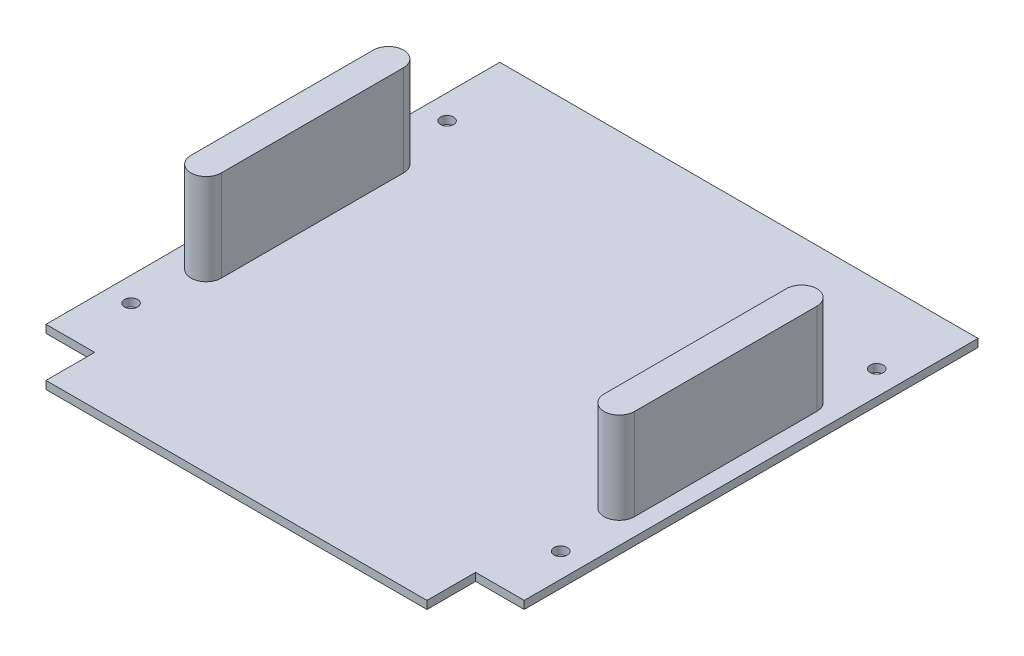
ISO-10303-21;
HEADER;
FILE_DESCRIPTION(('STEP AP214'),'2;1');
FILE_NAME('part.step','',(''),(''),'','','');
FILE_SCHEMA(('AUTOMOTIVE_DESIGN { 1 0 10303 214 1 1 1 1 }'));
ENDSEC;
DATA;
#1=APPLICATION_CONTEXT('core data for automotive mechanical design processes');
#2=APPLICATION_PROTOCOL_DEFINITION('international standard','automotive_design',2000,#1);
#3=PRODUCT_CONTEXT('',#1,'mechanical');
#4=PRODUCT('Part','Part','',(#3));
#5=PRODUCT_RELATED_PRODUCT_CATEGORY('part','',(#4));
#6=PRODUCT_DEFINITION_FORMATION('','',#4);
#7=PRODUCT_DEFINITION_CONTEXT('part definition',#1,'design');
#8=PRODUCT_DEFINITION('design','',#6,#7);
#9=PRODUCT_DEFINITION_SHAPE('','',#8);
#10=(LENGTH_UNIT() NAMED_UNIT(*) SI_UNIT(.MILLI.,.METRE.));
#11=(NAMED_UNIT(*) PLANE_ANGLE_UNIT() SI_UNIT($,.RADIAN.));
#12=(NAMED_UNIT(*) SI_UNIT($,.STERADIAN.) SOLID_ANGLE_UNIT());
#13=UNCERTAINTY_MEASURE_WITH_UNIT(LENGTH_MEASURE(1.E-05),#10,'distance_accuracy_value','');
#14=(GEOMETRIC_REPRESENTATION_CONTEXT(3) GLOBAL_UNCERTAINTY_ASSIGNED_CONTEXT((#13)) GLOBAL_UNIT_ASSIGNED_CONTEXT((#10,
#11,#12)) REPRESENTATION_CONTEXT('',''));
#15=CARTESIAN_POINT('',(0.,0.,0.));
#16=DIRECTION('',(0.,0.,1.));
#17=DIRECTION('',(1.,0.,0.));
#18=AXIS2_PLACEMENT_3D('',#15,#16,#17);
#19=CARTESIAN_POINT('',(0.,3.302,0.));
#20=DIRECTION('',(0.,1.,0.));
#21=DIRECTION('',(0.,0.,1.));
#22=AXIS2_PLACEMENT_3D('',#19,#20,#21);
#23=PLANE('',#22);
#24=CARTESIAN_POINT('',(-89.789,3.302,55.88));
#25=DIRECTION('',(0.,1.,0.));
#26=DIRECTION('',(0.,0.,1.));
#27=AXIS2_PLACEMENT_3D('',#24,#25,#26);
#28=CIRCLE('',#27,2.74999999999997);
#29=CARTESIAN_POINT('',(-89.789,3.302,58.63));
#30=VERTEX_POINT('',#29);
#31=EDGE_CURVE('E193',#30,#30,#28,.T.);
#32=ORIENTED_EDGE('',*,*,#31,.F.);
#33=EDGE_LOOP('',(#32));
#34=FACE_BOUND('',#33,.T.);
#35=CARTESIAN_POINT('',(-89.789,3.302,-76.2));
#36=DIRECTION('',(0.,1.,0.));
#37=DIRECTION('',(0.,0.,1.));
#38=AXIS2_PLACEMENT_3D('',#35,#36,#37);
#39=CIRCLE('',#38,2.74999999999997);
#40=CARTESIAN_POINT('',(-89.789,3.302,-73.4500000000001));
#41=VERTEX_POINT('',#40);
#42=EDGE_CURVE('E201',#41,#41,#39,.T.);
#43=ORIENTED_EDGE('',*,*,#42,.F.);
#44=EDGE_LOOP('',(#43));
#45=FACE_BOUND('',#44,.T.);
#46=CARTESIAN_POINT('',(89.789,3.302,55.88));
#47=DIRECTION('',(0.,1.,0.));
#48=DIRECTION('',(0.,0.,1.));
#49=AXIS2_PLACEMENT_3D('',#46,#47,#48);
#50=CIRCLE('',#49,2.74999999999997);
#51=CARTESIAN_POINT('',(89.789,3.302,58.63));
#52=VERTEX_POINT('',#51);
#53=EDGE_CURVE('E209',#52,#52,#50,.T.);
#54=ORIENTED_EDGE('',*,*,#53,.F.);
#55=EDGE_LOOP('',(#54));
#56=FACE_BOUND('',#55,.T.);
#57=CARTESIAN_POINT('',(89.789,3.302,-76.2));
#58=DIRECTION('',(0.,1.,0.));
#59=DIRECTION('',(0.,0.,1.));
#60=AXIS2_PLACEMENT_3D('',#57,#58,#59);
#61=CIRCLE('',#60,2.74999999999997);
#62=CARTESIAN_POINT('',(89.789,3.302,-73.4500000000001));
#63=VERTEX_POINT('',#62);
#64=EDGE_CURVE('E217',#63,#63,#61,.T.);
#65=ORIENTED_EDGE('',*,*,#64,.F.);
#66=EDGE_LOOP('',(#65));
#67=FACE_BOUND('',#66,.T.);
#68=DIRECTION('',(0.,0.,1.));
#69=VECTOR('',#68,1.);
#70=CARTESIAN_POINT('',(79.629,3.302,0.));
#71=LINE('',#70,#69);
#72=CARTESIAN_POINT('',(79.629,3.302,81.28));
#73=VERTEX_POINT('',#72);
#74=CARTESIAN_POINT('',(79.629,3.302,101.6));
#75=VERTEX_POINT('',#74);
#76=EDGE_CURVE('E304',#73,#75,#71,.T.);
#77=ORIENTED_EDGE('',*,*,#76,.F.);
#78=DIRECTION('',(-1.,0.,0.));
#79=VECTOR('',#78,1.);
#80=CARTESIAN_POINT('',(0.,3.302,81.28));
#81=LINE('',#80,#79);
#82=CARTESIAN_POINT('',(99.949,3.302,81.28));
#83=VERTEX_POINT('',#82);
#84=EDGE_CURVE('E308',#83,#73,#81,.T.);
#85=ORIENTED_EDGE('',*,*,#84,.F.);
#86=DIRECTION('',(0.,0.,1.));
#87=VECTOR('',#86,1.);
#88=CARTESIAN_POINT('',(99.949,3.302,0.));
#89=LINE('',#88,#87);
#90=CARTESIAN_POINT('',(99.949,3.302,-108.4));
#91=VERTEX_POINT('',#90);
#92=EDGE_CURVE('E313',#91,#83,#89,.T.);
#93=ORIENTED_EDGE('',*,*,#92,.F.);
#94=DIRECTION('',(1.,0.,0.));
#95=VECTOR('',#94,1.);
#96=CARTESIAN_POINT('',(99.949,3.302,-108.4));
#97=LINE('',#96,#95);
#98=CARTESIAN_POINT('',(-99.949,3.302,-108.4));
#99=VERTEX_POINT('',#98);
#100=EDGE_CURVE('E185',#99,#91,#97,.T.);
#101=ORIENTED_EDGE('',*,*,#100,.F.);
#102=DIRECTION('',(0.,0.,1.));
#103=VECTOR('',#102,1.);
#104=CARTESIAN_POINT('',(-99.949,3.302,0.));
#105=LINE('',#104,#103);
#106=CARTESIAN_POINT('',(-99.949,3.302,81.28));
#107=VERTEX_POINT('',#106);
#108=EDGE_CURVE('E316',#99,#107,#105,.T.);
#109=ORIENTED_EDGE('',*,*,#108,.T.);
#110=DIRECTION('',(1.,0.,0.));
#111=VECTOR('',#110,1.);
#112=CARTESIAN_POINT('',(0.,3.302,81.28));
#113=LINE('',#112,#111);
#114=CARTESIAN_POINT('',(-79.629,3.302,81.28));
#115=VERTEX_POINT('',#114);
#116=EDGE_CURVE('E319',#107,#115,#113,.T.);
#117=ORIENTED_EDGE('',*,*,#116,.T.);
#118=DIRECTION('',(0.,0.,1.));
#119=VECTOR('',#118,1.);
#120=CARTESIAN_POINT('',(-79.629,3.302,0.));
#121=LINE('',#120,#119);
#122=CARTESIAN_POINT('',(-79.629,3.302,101.6));
#123=VERTEX_POINT('',#122);
#124=EDGE_CURVE('E322',#115,#123,#121,.T.);
#125=ORIENTED_EDGE('',*,*,#124,.T.);
#126=DIRECTION('',(-1.,0.,0.));
#127=VECTOR('',#126,1.);
#128=CARTESIAN_POINT('',(0.,3.302,101.6));
#129=LINE('',#128,#127);
#130=EDGE_CURVE('E325',#75,#123,#129,.T.);
#131=ORIENTED_EDGE('',*,*,#130,.F.);
#132=EDGE_LOOP('',(#77,#85,#93,#101,#109,#117,#125,#131));
#133=FACE_BOUND('',#132,.T.);
#134=DIRECTION('',(0.,0.,1.));
#135=VECTOR('',#134,1.);
#136=CARTESIAN_POINT('',(80.01,3.302,-48.26));
#137=LINE('',#136,#135);
#138=CARTESIAN_POINT('',(80.01,3.302,-48.26));
#139=VERTEX_POINT('',#138);
#140=CARTESIAN_POINT('',(80.01,3.302,27.94));
#141=VERTEX_POINT('',#140);
#142=EDGE_CURVE('E283',#139,#141,#137,.T.);
#143=ORIENTED_EDGE('',*,*,#142,.F.);
#144=CARTESIAN_POINT('',(86.36,3.302,-48.26));
#145=DIRECTION('',(0.,1.,0.));
#146=DIRECTION('',(0.,0.,1.));
#147=AXIS2_PLACEMENT_3D('',#144,#145,#146);
#148=CIRCLE('',#147,6.35);
#149=CARTESIAN_POINT('',(92.71,3.302,-48.26));
#150=VERTEX_POINT('',#149);
#151=EDGE_CURVE('E264',#150,#139,#148,.T.);
#152=ORIENTED_EDGE('',*,*,#151,.F.);
#153=DIRECTION('',(0.,0.,-1.));
#154=VECTOR('',#153,1.);
#155=CARTESIAN_POINT('',(92.71,3.302,-48.26));
#156=LINE('',#155,#154);
#157=CARTESIAN_POINT('',(92.71,3.302,27.94));
#158=VERTEX_POINT('',#157);
#159=EDGE_CURVE('E270',#158,#150,#156,.T.);
#160=ORIENTED_EDGE('',*,*,#159,.F.);
#161=CARTESIAN_POINT('',(86.36,3.302,27.94));
#162=DIRECTION('',(0.,1.,0.));
#163=DIRECTION('',(0.,0.,1.));
#164=AXIS2_PLACEMENT_3D('',#161,#162,#163);
#165=CIRCLE('',#164,6.35);
#166=EDGE_CURVE('E286',#141,#158,#165,.T.);
#167=ORIENTED_EDGE('',*,*,#166,.F.);
#168=EDGE_LOOP('',(#143,#152,#160,#167));
#169=FACE_BOUND('',#168,.T.);
#170=DIRECTION('',(0.,0.,1.));
#171=VECTOR('',#170,1.);
#172=CARTESIAN_POINT('',(-92.71,3.302,-48.26));
#173=LINE('',#172,#171);
#174=CARTESIAN_POINT('',(-92.71,3.302,-48.26));
#175=VERTEX_POINT('',#174);
#176=CARTESIAN_POINT('',(-92.71,3.302,27.94));
#177=VERTEX_POINT('',#176);
#178=EDGE_CURVE('E244',#175,#177,#173,.T.);
#179=ORIENTED_EDGE('',*,*,#178,.F.);
#180=CARTESIAN_POINT('',(-86.36,3.302,-48.26));
#181=DIRECTION('',(0.,1.,0.));
#182=DIRECTION('',(0.,0.,1.));
#183=AXIS2_PLACEMENT_3D('',#180,#181,#182);
#184=CIRCLE('',#183,6.35);
#185=CARTESIAN_POINT('',(-80.01,3.302,-48.26));
#186=VERTEX_POINT('',#185);
#187=EDGE_CURVE('E225',#186,#175,#184,.T.);
#188=ORIENTED_EDGE('',*,*,#187,.F.);
#189=DIRECTION('',(0.,0.,-1.));
#190=VECTOR('',#189,1.);
#191=CARTESIAN_POINT('',(-80.01,3.302,-48.26));
#192=LINE('',#191,#190);
#193=CARTESIAN_POINT('',(-80.01,3.302,27.94));
#194=VERTEX_POINT('',#193);
#195=EDGE_CURVE('E231',#194,#186,#192,.T.);
#196=ORIENTED_EDGE('',*,*,#195,.F.);
#197=CARTESIAN_POINT('',(-86.36,3.302,27.94));
#198=DIRECTION('',(0.,1.,0.));
#199=DIRECTION('',(0.,0.,1.));
#200=AXIS2_PLACEMENT_3D('',#197,#198,#199);
#201=CIRCLE('',#200,6.35);
#202=EDGE_CURVE('E247',#177,#194,#201,.T.);
#203=ORIENTED_EDGE('',*,*,#202,.F.);
#204=EDGE_LOOP('',(#179,#188,#196,#203));
#205=FACE_BOUND('',#204,.T.);
#206=ADVANCED_FACE('F43',(#34,#45,#56,#67,#133,#169,#205),#23,.T.);
#207=CARTESIAN_POINT('',(79.629,3.302,0.));
#208=DIRECTION('',(1.,0.,0.));
#209=DIRECTION('',(0.,0.,-1.));
#210=AXIS2_PLACEMENT_3D('',#207,#208,#209);
#211=PLANE('',#210);
#212=DIRECTION('',(0.,0.,1.));
#213=VECTOR('',#212,1.);
#214=CARTESIAN_POINT('',(79.629,0.,0.));
#215=LINE('',#214,#213);
#216=CARTESIAN_POINT('',(79.629,0.,81.28));
#217=VERTEX_POINT('',#216);
#218=CARTESIAN_POINT('',(79.629,0.,101.6));
#219=VERTEX_POINT('',#218);
#220=EDGE_CURVE('E303',#217,#219,#215,.T.);
#221=ORIENTED_EDGE('',*,*,#220,.F.);
#222=DIRECTION('',(0.,-1.,0.));
#223=VECTOR('',#222,1.);
#224=CARTESIAN_POINT('',(79.629,3.302,81.28));
#225=LINE('',#224,#223);
#226=EDGE_CURVE('E11',#73,#217,#225,.T.);
#227=ORIENTED_EDGE('',*,*,#226,.F.);
#228=ORIENTED_EDGE('',*,*,#76,.T.);
#229=DIRECTION('',(0.,-1.,0.));
#230=VECTOR('',#229,1.);
#231=CARTESIAN_POINT('',(79.629,3.302,101.6));
#232=LINE('',#231,#230);
#233=EDGE_CURVE('E329',#75,#219,#232,.T.);
#234=ORIENTED_EDGE('',*,*,#233,.T.);
#235=EDGE_LOOP('',(#221,#227,#228,#234));
#236=FACE_BOUND('',#235,.T.);
#237=ADVANCED_FACE('F45',(#236),#211,.T.);
#238=CARTESIAN_POINT('',(0.,3.302,81.28));
#239=DIRECTION('',(0.,0.,1.));
#240=DIRECTION('',(1.,0.,0.));
#241=AXIS2_PLACEMENT_3D('',#238,#239,#240);
#242=PLANE('',#241);
#243=DIRECTION('',(-1.,0.,0.));
#244=VECTOR('',#243,1.);
#245=CARTESIAN_POINT('',(0.,0.,81.28));
#246=LINE('',#245,#244);
#247=CARTESIAN_POINT('',(99.949,0.,81.28));
#248=VERTEX_POINT('',#247);
#249=EDGE_CURVE('E169',#248,#217,#246,.T.);
#250=ORIENTED_EDGE('',*,*,#249,.F.);
#251=DIRECTION('',(0.,-1.,0.));
#252=VECTOR('',#251,1.);
#253=CARTESIAN_POINT('',(99.949,3.302,81.28));
#254=LINE('',#253,#252);
#255=EDGE_CURVE('E52',#83,#248,#254,.T.);
#256=ORIENTED_EDGE('',*,*,#255,.F.);
#257=ORIENTED_EDGE('',*,*,#84,.T.);
#258=ORIENTED_EDGE('',*,*,#226,.T.);
#259=EDGE_LOOP('',(#250,#256,#257,#258));
#260=FACE_BOUND('',#259,.T.);
#261=ADVANCED_FACE('F384',(#260),#242,.T.);
#262=CARTESIAN_POINT('',(99.949,3.302,0.));
#263=DIRECTION('',(1.,0.,0.));
#264=DIRECTION('',(0.,0.,-1.));
#265=AXIS2_PLACEMENT_3D('',#262,#263,#264);
#266=PLANE('',#265);
#267=DIRECTION('',(0.,0.,1.));
#268=VECTOR('',#267,1.);
#269=CARTESIAN_POINT('',(99.949,0.,0.));
#270=LINE('',#269,#268);
#271=CARTESIAN_POINT('',(99.949,0.,-108.4));
#272=VERTEX_POINT('',#271);
#273=EDGE_CURVE('E158',#272,#248,#270,.T.);
#274=ORIENTED_EDGE('',*,*,#273,.F.);
#275=DIRECTION('',(0.,-1.,0.));
#276=VECTOR('',#275,1.);
#277=CARTESIAN_POINT('',(99.949,3.302,-108.4));
#278=LINE('',#277,#276);
#279=EDGE_CURVE('E163',#91,#272,#278,.T.);
#280=ORIENTED_EDGE('',*,*,#279,.F.);
#281=ORIENTED_EDGE('',*,*,#92,.T.);
#282=ORIENTED_EDGE('',*,*,#255,.T.);
#283=EDGE_LOOP('',(#274,#280,#281,#282));
#284=FACE_BOUND('',#283,.T.);
#285=ADVANCED_FACE('F160',(#284),#266,.T.);
#286=CARTESIAN_POINT('',(-99.949,3.302,0.));
#287=DIRECTION('',(1.,0.,0.));
#288=DIRECTION('',(0.,0.,-1.));
#289=AXIS2_PLACEMENT_3D('',#286,#287,#288);
#290=PLANE('',#289);
#291=DIRECTION('',(0.,0.,1.));
#292=VECTOR('',#291,1.);
#293=CARTESIAN_POINT('',(-99.949,0.,0.));
#294=LINE('',#293,#292);
#295=CARTESIAN_POINT('',(-99.949,0.,-108.4));
#296=VERTEX_POINT('',#295);
#297=CARTESIAN_POINT('',(-99.949,0.,81.28));
#298=VERTEX_POINT('',#297);
#299=EDGE_CURVE('E168',#296,#298,#294,.T.);
#300=ORIENTED_EDGE('',*,*,#299,.T.);
#301=DIRECTION('',(0.,-1.,0.));
#302=VECTOR('',#301,1.);
#303=CARTESIAN_POINT('',(-99.949,3.302,81.28));
#304=LINE('',#303,#302);
#305=EDGE_CURVE('E355',#107,#298,#304,.T.);
#306=ORIENTED_EDGE('',*,*,#305,.F.);
#307=ORIENTED_EDGE('',*,*,#108,.F.);
#308=DIRECTION('',(0.,1.,0.));
#309=VECTOR('',#308,1.);
#310=CARTESIAN_POINT('',(-99.949,3.302,-108.4));
#311=LINE('',#310,#309);
#312=EDGE_CURVE('E180',#296,#99,#311,.T.);
#313=ORIENTED_EDGE('',*,*,#312,.F.);
#314=EDGE_LOOP('',(#300,#306,#307,#313));
#315=FACE_BOUND('',#314,.T.);
#316=ADVANCED_FACE('F375',(#315),#290,.F.);
#317=CARTESIAN_POINT('',(0.,3.302,81.28));
#318=DIRECTION('',(0.,0.,-1.));
#319=DIRECTION('',(-1.,0.,0.));
#320=AXIS2_PLACEMENT_3D('',#317,#318,#319);
#321=PLANE('',#320);
#322=DIRECTION('',(1.,0.,0.));
#323=VECTOR('',#322,1.);
#324=CARTESIAN_POINT('',(0.,0.,81.28));
#325=LINE('',#324,#323);
#326=CARTESIAN_POINT('',(-79.629,0.,81.28));
#327=VERTEX_POINT('',#326);
#328=EDGE_CURVE('E336',#298,#327,#325,.T.);
#329=ORIENTED_EDGE('',*,*,#328,.T.);
#330=DIRECTION('',(0.,-1.,0.));
#331=VECTOR('',#330,1.);
#332=CARTESIAN_POINT('',(-79.629,3.302,81.28));
#333=LINE('',#332,#331);
#334=EDGE_CURVE('E351',#115,#327,#333,.T.);
#335=ORIENTED_EDGE('',*,*,#334,.F.);
#336=ORIENTED_EDGE('',*,*,#116,.F.);
#337=ORIENTED_EDGE('',*,*,#305,.T.);
#338=EDGE_LOOP('',(#329,#335,#336,#337));
#339=FACE_BOUND('',#338,.T.);
#340=ADVANCED_FACE('F362',(#339),#321,.F.);
#341=CARTESIAN_POINT('',(-79.629,3.302,0.));
#342=DIRECTION('',(1.,0.,0.));
#343=DIRECTION('',(0.,0.,-1.));
#344=AXIS2_PLACEMENT_3D('',#341,#342,#343);
#345=PLANE('',#344);
#346=DIRECTION('',(0.,0.,1.));
#347=VECTOR('',#346,1.);
#348=CARTESIAN_POINT('',(-79.629,0.,0.));
#349=LINE('',#348,#347);
#350=CARTESIAN_POINT('',(-79.629,0.,101.6));
#351=VERTEX_POINT('',#350);
#352=EDGE_CURVE('E339',#327,#351,#349,.T.);
#353=ORIENTED_EDGE('',*,*,#352,.T.);
#354=DIRECTION('',(0.,-1.,0.));
#355=VECTOR('',#354,1.);
#356=CARTESIAN_POINT('',(-79.629,3.302,101.6));
#357=LINE('',#356,#355);
#358=EDGE_CURVE('E348',#123,#351,#357,.T.);
#359=ORIENTED_EDGE('',*,*,#358,.F.);
#360=ORIENTED_EDGE('',*,*,#124,.F.);
#361=ORIENTED_EDGE('',*,*,#334,.T.);
#362=EDGE_LOOP('',(#353,#359,#360,#361));
#363=FACE_BOUND('',#362,.T.);
#364=ADVANCED_FACE('F369',(#363),#345,.F.);
#365=CARTESIAN_POINT('',(0.,3.302,101.6));
#366=DIRECTION('',(0.,0.,1.));
#367=DIRECTION('',(1.,0.,0.));
#368=AXIS2_PLACEMENT_3D('',#365,#366,#367);
#369=PLANE('',#368);
#370=DIRECTION('',(-1.,0.,0.));
#371=VECTOR('',#370,1.);
#372=CARTESIAN_POINT('',(0.,0.,101.6));
#373=LINE('',#372,#371);
#374=EDGE_CURVE('E309',#219,#351,#373,.T.);
#375=ORIENTED_EDGE('',*,*,#374,.F.);
#376=ORIENTED_EDGE('',*,*,#233,.F.);
#377=ORIENTED_EDGE('',*,*,#130,.T.);
#378=ORIENTED_EDGE('',*,*,#358,.T.);
#379=EDGE_LOOP('',(#375,#376,#377,#378));
#380=FACE_BOUND('',#379,.T.);
#381=ADVANCED_FACE('F401',(#380),#369,.T.);
#382=CARTESIAN_POINT('',(0.,0.,0.));
#383=DIRECTION('',(0.,1.,0.));
#384=DIRECTION('',(0.,0.,1.));
#385=AXIS2_PLACEMENT_3D('',#382,#383,#384);
#386=PLANE('',#385);
#387=CARTESIAN_POINT('',(-89.789,0.,55.88));
#388=DIRECTION('',(0.,1.,0.));
#389=DIRECTION('',(0.,0.,1.));
#390=AXIS2_PLACEMENT_3D('',#387,#388,#389);
#391=CIRCLE('',#390,2.74999999999997);
#392=CARTESIAN_POINT('',(-89.789,0.,58.63));
#393=VERTEX_POINT('',#392);
#394=EDGE_CURVE('E197',#393,#393,#391,.T.);
#395=ORIENTED_EDGE('',*,*,#394,.T.);
#396=EDGE_LOOP('',(#395));
#397=FACE_BOUND('',#396,.T.);
#398=CARTESIAN_POINT('',(-89.789,0.,-76.2));
#399=DIRECTION('',(0.,1.,0.));
#400=DIRECTION('',(0.,0.,1.));
#401=AXIS2_PLACEMENT_3D('',#398,#399,#400);
#402=CIRCLE('',#401,2.74999999999997);
#403=CARTESIAN_POINT('',(-89.789,0.,-73.4500000000001));
#404=VERTEX_POINT('',#403);
#405=EDGE_CURVE('E205',#404,#404,#402,.T.);
#406=ORIENTED_EDGE('',*,*,#405,.T.);
#407=EDGE_LOOP('',(#406));
#408=FACE_BOUND('',#407,.T.);
#409=CARTESIAN_POINT('',(89.789,0.,55.88));
#410=DIRECTION('',(0.,1.,0.));
#411=DIRECTION('',(0.,0.,1.));
#412=AXIS2_PLACEMENT_3D('',#409,#410,#411);
#413=CIRCLE('',#412,2.74999999999997);
#414=CARTESIAN_POINT('',(89.789,0.,58.63));
#415=VERTEX_POINT('',#414);
#416=EDGE_CURVE('E213',#415,#415,#413,.T.);
#417=ORIENTED_EDGE('',*,*,#416,.T.);
#418=EDGE_LOOP('',(#417));
#419=FACE_BOUND('',#418,.T.);
#420=CARTESIAN_POINT('',(89.789,0.,-76.2));
#421=DIRECTION('',(0.,1.,0.));
#422=DIRECTION('',(0.,0.,1.));
#423=AXIS2_PLACEMENT_3D('',#420,#421,#422);
#424=CIRCLE('',#423,2.74999999999997);
#425=CARTESIAN_POINT('',(89.789,0.,-73.4500000000001));
#426=VERTEX_POINT('',#425);
#427=EDGE_CURVE('E221',#426,#426,#424,.T.);
#428=ORIENTED_EDGE('',*,*,#427,.T.);
#429=EDGE_LOOP('',(#428));
#430=FACE_BOUND('',#429,.T.);
#431=ORIENTED_EDGE('',*,*,#220,.T.);
#432=ORIENTED_EDGE('',*,*,#374,.T.);
#433=ORIENTED_EDGE('',*,*,#352,.F.);
#434=ORIENTED_EDGE('',*,*,#328,.F.);
#435=ORIENTED_EDGE('',*,*,#299,.F.);
#436=DIRECTION('',(-1.,0.,0.));
#437=VECTOR('',#436,1.);
#438=CARTESIAN_POINT('',(99.949,0.,-108.4));
#439=LINE('',#438,#437);
#440=EDGE_CURVE('E172',#272,#296,#439,.T.);
#441=ORIENTED_EDGE('',*,*,#440,.F.);
#442=ORIENTED_EDGE('',*,*,#273,.T.);
#443=ORIENTED_EDGE('',*,*,#249,.T.);
#444=EDGE_LOOP('',(#431,#432,#433,#434,#435,#441,#442,#443));
#445=FACE_BOUND('',#444,.T.);
#446=ADVANCED_FACE('F174',(#397,#408,#419,#430,#445),#386,.F.);
#447=CARTESIAN_POINT('',(86.36,41.402,-48.26));
#448=DIRECTION('',(0.,-1.,0.));
#449=DIRECTION('',(0.,0.,-1.));
#450=AXIS2_PLACEMENT_3D('',#447,#448,#449);
#451=CYLINDRICAL_SURFACE('',#450,6.35);
#452=ORIENTED_EDGE('',*,*,#151,.T.);
#453=DIRECTION('',(0.,-1.,0.));
#454=VECTOR('',#453,1.);
#455=CARTESIAN_POINT('',(80.01,41.402,-48.26));
#456=LINE('',#455,#454);
#457=CARTESIAN_POINT('',(80.01,41.402,-48.26));
#458=VERTEX_POINT('',#457);
#459=EDGE_CURVE('E300',#458,#139,#456,.T.);
#460=ORIENTED_EDGE('',*,*,#459,.F.);
#461=CARTESIAN_POINT('',(86.36,41.402,-48.26));
#462=DIRECTION('',(0.,1.,0.));
#463=DIRECTION('',(0.,0.,1.));
#464=AXIS2_PLACEMENT_3D('',#461,#462,#463);
#465=CIRCLE('',#464,6.35);
#466=CARTESIAN_POINT('',(92.71,41.402,-48.26));
#467=VERTEX_POINT('',#466);
#468=EDGE_CURVE('E265',#467,#458,#465,.T.);
#469=ORIENTED_EDGE('',*,*,#468,.F.);
#470=DIRECTION('',(0.,-1.,0.));
#471=VECTOR('',#470,1.);
#472=CARTESIAN_POINT('',(92.71,41.402,-48.26));
#473=LINE('',#472,#471);
#474=EDGE_CURVE('E279',#467,#150,#473,.T.);
#475=ORIENTED_EDGE('',*,*,#474,.T.);
#476=EDGE_LOOP('',(#452,#460,#469,#475));
#477=FACE_BOUND('',#476,.T.);
#478=ADVANCED_FACE('F398',(#477),#451,.T.);
#479=CARTESIAN_POINT('',(80.01,41.402,-48.26));
#480=DIRECTION('',(1.,0.,0.));
#481=DIRECTION('',(0.,0.,-1.));
#482=AXIS2_PLACEMENT_3D('',#479,#480,#481);
#483=PLANE('',#482);
#484=ORIENTED_EDGE('',*,*,#142,.T.);
#485=DIRECTION('',(0.,-1.,0.));
#486=VECTOR('',#485,1.);
#487=CARTESIAN_POINT('',(80.01,41.402,27.94));
#488=LINE('',#487,#486);
#489=CARTESIAN_POINT('',(80.01,41.402,27.94));
#490=VERTEX_POINT('',#489);
#491=EDGE_CURVE('E296',#490,#141,#488,.T.);
#492=ORIENTED_EDGE('',*,*,#491,.F.);
#493=DIRECTION('',(0.,0.,1.));
#494=VECTOR('',#493,1.);
#495=CARTESIAN_POINT('',(80.01,41.402,-48.26));
#496=LINE('',#495,#494);
#497=EDGE_CURVE('E269',#458,#490,#496,.T.);
#498=ORIENTED_EDGE('',*,*,#497,.F.);
#499=ORIENTED_EDGE('',*,*,#459,.T.);
#500=EDGE_LOOP('',(#484,#492,#498,#499));
#501=FACE_BOUND('',#500,.T.);
#502=ADVANCED_FACE('F422',(#501),#483,.F.);
#503=CARTESIAN_POINT('',(86.36,41.402,27.94));
#504=DIRECTION('',(0.,-1.,0.));
#505=DIRECTION('',(0.,0.,-1.));
#506=AXIS2_PLACEMENT_3D('',#503,#504,#505);
#507=CYLINDRICAL_SURFACE('',#506,6.35);
#508=ORIENTED_EDGE('',*,*,#166,.T.);
#509=DIRECTION('',(0.,-1.,0.));
#510=VECTOR('',#509,1.);
#511=CARTESIAN_POINT('',(92.71,41.402,27.94));
#512=LINE('',#511,#510);
#513=CARTESIAN_POINT('',(92.71,41.402,27.94));
#514=VERTEX_POINT('',#513);
#515=EDGE_CURVE('E67',#514,#158,#512,.T.);
#516=ORIENTED_EDGE('',*,*,#515,.F.);
#517=CARTESIAN_POINT('',(86.36,41.402,27.94));
#518=DIRECTION('',(0.,1.,0.));
#519=DIRECTION('',(0.,0.,1.));
#520=AXIS2_PLACEMENT_3D('',#517,#518,#519);
#521=CIRCLE('',#520,6.35);
#522=EDGE_CURVE('E273',#490,#514,#521,.T.);
#523=ORIENTED_EDGE('',*,*,#522,.F.);
#524=ORIENTED_EDGE('',*,*,#491,.T.);
#525=EDGE_LOOP('',(#508,#516,#523,#524));
#526=FACE_BOUND('',#525,.T.);
#527=ADVANCED_FACE('F429',(#526),#507,.T.);
#528=CARTESIAN_POINT('',(92.71,41.402,-48.26));
#529=DIRECTION('',(-1.,0.,0.));
#530=DIRECTION('',(0.,0.,1.));
#531=AXIS2_PLACEMENT_3D('',#528,#529,#530);
#532=PLANE('',#531);
#533=ORIENTED_EDGE('',*,*,#159,.T.);
#534=ORIENTED_EDGE('',*,*,#474,.F.);
#535=DIRECTION('',(0.,0.,-1.));
#536=VECTOR('',#535,1.);
#537=CARTESIAN_POINT('',(92.71,41.402,-48.26));
#538=LINE('',#537,#536);
#539=EDGE_CURVE('E276',#514,#467,#538,.T.);
#540=ORIENTED_EDGE('',*,*,#539,.F.);
#541=ORIENTED_EDGE('',*,*,#515,.T.);
#542=EDGE_LOOP('',(#533,#534,#540,#541));
#543=FACE_BOUND('',#542,.T.);
#544=ADVANCED_FACE('F436',(#543),#532,.F.);
#545=CARTESIAN_POINT('',(86.36,41.402,-48.26));
#546=DIRECTION('',(0.,1.,0.));
#547=DIRECTION('',(0.,0.,1.));
#548=AXIS2_PLACEMENT_3D('',#545,#546,#547);
#549=PLANE('',#548);
#550=ORIENTED_EDGE('',*,*,#468,.T.);
#551=ORIENTED_EDGE('',*,*,#497,.T.);
#552=ORIENTED_EDGE('',*,*,#522,.T.);
#553=ORIENTED_EDGE('',*,*,#539,.T.);
#554=EDGE_LOOP('',(#550,#551,#552,#553));
#555=FACE_BOUND('',#554,.T.);
#556=ADVANCED_FACE('F444',(#555),#549,.T.);
#557=CARTESIAN_POINT('',(-86.36,41.402,-48.26));
#558=DIRECTION('',(0.,-1.,0.));
#559=DIRECTION('',(0.,0.,-1.));
#560=AXIS2_PLACEMENT_3D('',#557,#558,#559);
#561=CYLINDRICAL_SURFACE('',#560,6.35);
#562=ORIENTED_EDGE('',*,*,#187,.T.);
#563=DIRECTION('',(0.,-1.,0.));
#564=VECTOR('',#563,1.);
#565=CARTESIAN_POINT('',(-92.71,41.402,-48.26));
#566=LINE('',#565,#564);
#567=CARTESIAN_POINT('',(-92.71,41.402,-48.26));
#568=VERTEX_POINT('',#567);
#569=EDGE_CURVE('E261',#568,#175,#566,.T.);
#570=ORIENTED_EDGE('',*,*,#569,.F.);
#571=CARTESIAN_POINT('',(-86.36,41.402,-48.26));
#572=DIRECTION('',(0.,1.,0.));
#573=DIRECTION('',(0.,0.,1.));
#574=AXIS2_PLACEMENT_3D('',#571,#572,#573);
#575=CIRCLE('',#574,6.35);
#576=CARTESIAN_POINT('',(-80.01,41.402,-48.26));
#577=VERTEX_POINT('',#576);
#578=EDGE_CURVE('E226',#577,#568,#575,.T.);
#579=ORIENTED_EDGE('',*,*,#578,.F.);
#580=DIRECTION('',(0.,-1.,0.));
#581=VECTOR('',#580,1.);
#582=CARTESIAN_POINT('',(-80.01,41.402,-48.26));
#583=LINE('',#582,#581);
#584=EDGE_CURVE('E240',#577,#186,#583,.T.);
#585=ORIENTED_EDGE('',*,*,#584,.T.);
#586=EDGE_LOOP('',(#562,#570,#579,#585));
#587=FACE_BOUND('',#586,.T.);
#588=ADVANCED_FACE('F451',(#587),#561,.T.);
#589=CARTESIAN_POINT('',(-92.71,41.402,-48.26));
#590=DIRECTION('',(1.,0.,0.));
#591=DIRECTION('',(0.,0.,-1.));
#592=AXIS2_PLACEMENT_3D('',#589,#590,#591);
#593=PLANE('',#592);
#594=ORIENTED_EDGE('',*,*,#178,.T.);
#595=DIRECTION('',(0.,-1.,0.));
#596=VECTOR('',#595,1.);
#597=CARTESIAN_POINT('',(-92.71,41.402,27.94));
#598=LINE('',#597,#596);
#599=CARTESIAN_POINT('',(-92.71,41.402,27.94));
#600=VERTEX_POINT('',#599);
#601=EDGE_CURVE('E257',#600,#177,#598,.T.);
#602=ORIENTED_EDGE('',*,*,#601,.F.);
#603=DIRECTION('',(0.,0.,1.));
#604=VECTOR('',#603,1.);
#605=CARTESIAN_POINT('',(-92.71,41.402,-48.26));
#606=LINE('',#605,#604);
#607=EDGE_CURVE('E230',#568,#600,#606,.T.);
#608=ORIENTED_EDGE('',*,*,#607,.F.);
#609=ORIENTED_EDGE('',*,*,#569,.T.);
#610=EDGE_LOOP('',(#594,#602,#608,#609));
#611=FACE_BOUND('',#610,.T.);
#612=ADVANCED_FACE('F459',(#611),#593,.F.);
#613=CARTESIAN_POINT('',(-86.36,41.402,27.94));
#614=DIRECTION('',(0.,-1.,0.));
#615=DIRECTION('',(0.,0.,-1.));
#616=AXIS2_PLACEMENT_3D('',#613,#614,#615);
#617=CYLINDRICAL_SURFACE('',#616,6.35);
#618=ORIENTED_EDGE('',*,*,#202,.T.);
#619=DIRECTION('',(0.,-1.,0.));
#620=VECTOR('',#619,1.);
#621=CARTESIAN_POINT('',(-80.01,41.402,27.94));
#622=LINE('',#621,#620);
#623=CARTESIAN_POINT('',(-80.01,41.402,27.94));
#624=VERTEX_POINT('',#623);
#625=EDGE_CURVE('E59',#624,#194,#622,.T.);
#626=ORIENTED_EDGE('',*,*,#625,.F.);
#627=CARTESIAN_POINT('',(-86.36,41.402,27.94));
#628=DIRECTION('',(0.,1.,0.));
#629=DIRECTION('',(0.,0.,1.));
#630=AXIS2_PLACEMENT_3D('',#627,#628,#629);
#631=CIRCLE('',#630,6.35);
#632=EDGE_CURVE('E234',#600,#624,#631,.T.);
#633=ORIENTED_EDGE('',*,*,#632,.F.);
#634=ORIENTED_EDGE('',*,*,#601,.T.);
#635=EDGE_LOOP('',(#618,#626,#633,#634));
#636=FACE_BOUND('',#635,.T.);
#637=ADVANCED_FACE('F467',(#636),#617,.T.);
#638=CARTESIAN_POINT('',(-80.01,41.402,-48.26));
#639=DIRECTION('',(-1.,0.,0.));
#640=DIRECTION('',(0.,0.,1.));
#641=AXIS2_PLACEMENT_3D('',#638,#639,#640);
#642=PLANE('',#641);
#643=ORIENTED_EDGE('',*,*,#195,.T.);
#644=ORIENTED_EDGE('',*,*,#584,.F.);
#645=DIRECTION('',(0.,0.,-1.));
#646=VECTOR('',#645,1.);
#647=CARTESIAN_POINT('',(-80.01,41.402,-48.26));
#648=LINE('',#647,#646);
#649=EDGE_CURVE('E237',#624,#577,#648,.T.);
#650=ORIENTED_EDGE('',*,*,#649,.F.);
#651=ORIENTED_EDGE('',*,*,#625,.T.);
#652=EDGE_LOOP('',(#643,#644,#650,#651));
#653=FACE_BOUND('',#652,.T.);
#654=ADVANCED_FACE('F475',(#653),#642,.F.);
#655=CARTESIAN_POINT('',(-86.36,41.402,-48.26));
#656=DIRECTION('',(0.,1.,0.));
#657=DIRECTION('',(0.,0.,1.));
#658=AXIS2_PLACEMENT_3D('',#655,#656,#657);
#659=PLANE('',#658);
#660=ORIENTED_EDGE('',*,*,#578,.T.);
#661=ORIENTED_EDGE('',*,*,#607,.T.);
#662=ORIENTED_EDGE('',*,*,#632,.T.);
#663=ORIENTED_EDGE('',*,*,#649,.T.);
#664=EDGE_LOOP('',(#660,#661,#662,#663));
#665=FACE_BOUND('',#664,.T.);
#666=ADVANCED_FACE('F483',(#665),#659,.T.);
#667=CARTESIAN_POINT('',(89.789,3.302,-76.2));
#668=DIRECTION('',(0.,1.,0.));
#669=DIRECTION('',(0.,0.,1.));
#670=AXIS2_PLACEMENT_3D('',#667,#668,#669);
#671=CYLINDRICAL_SURFACE('',#670,2.74999999999997);
#672=ORIENTED_EDGE('',*,*,#427,.F.);
#673=EDGE_LOOP('',(#672));
#674=FACE_BOUND('',#673,.T.);
#675=ORIENTED_EDGE('',*,*,#64,.T.);
#676=EDGE_LOOP('',(#675));
#677=FACE_BOUND('',#676,.T.);
#678=ADVANCED_FACE('F490',(#674,#677),#671,.F.);
#679=CARTESIAN_POINT('',(89.789,3.302,55.88));
#680=DIRECTION('',(0.,1.,0.));
#681=DIRECTION('',(0.,0.,1.));
#682=AXIS2_PLACEMENT_3D('',#679,#680,#681);
#683=CYLINDRICAL_SURFACE('',#682,2.74999999999997);
#684=ORIENTED_EDGE('',*,*,#416,.F.);
#685=EDGE_LOOP('',(#684));
#686=FACE_BOUND('',#685,.T.);
#687=ORIENTED_EDGE('',*,*,#53,.T.);
#688=EDGE_LOOP('',(#687));
#689=FACE_BOUND('',#688,.T.);
#690=ADVANCED_FACE('F498',(#686,#689),#683,.F.);
#691=CARTESIAN_POINT('',(-89.789,3.302,-76.2));
#692=DIRECTION('',(0.,1.,0.));
#693=DIRECTION('',(0.,0.,1.));
#694=AXIS2_PLACEMENT_3D('',#691,#692,#693);
#695=CYLINDRICAL_SURFACE('',#694,2.74999999999997);
#696=ORIENTED_EDGE('',*,*,#405,.F.);
#697=EDGE_LOOP('',(#696));
#698=FACE_BOUND('',#697,.T.);
#699=ORIENTED_EDGE('',*,*,#42,.T.);
#700=EDGE_LOOP('',(#699));
#701=FACE_BOUND('',#700,.T.);
#702=ADVANCED_FACE('F506',(#698,#701),#695,.F.);
#703=CARTESIAN_POINT('',(-89.789,3.302,55.88));
#704=DIRECTION('',(0.,1.,0.));
#705=DIRECTION('',(0.,0.,1.));
#706=AXIS2_PLACEMENT_3D('',#703,#704,#705);
#707=CYLINDRICAL_SURFACE('',#706,2.74999999999997);
#708=ORIENTED_EDGE('',*,*,#394,.F.);
#709=EDGE_LOOP('',(#708));
#710=FACE_BOUND('',#709,.T.);
#711=ORIENTED_EDGE('',*,*,#31,.T.);
#712=EDGE_LOOP('',(#711));
#713=FACE_BOUND('',#712,.T.);
#714=ADVANCED_FACE('F513',(#710,#713),#707,.F.);
#715=CARTESIAN_POINT('',(0.,0.,-108.4));
#716=DIRECTION('',(0.,0.,-1.));
#717=DIRECTION('',(-1.,0.,0.));
#718=AXIS2_PLACEMENT_3D('',#715,#716,#717);
#719=PLANE('',#718);
#720=ORIENTED_EDGE('',*,*,#279,.T.);
#721=ORIENTED_EDGE('',*,*,#440,.T.);
#722=ORIENTED_EDGE('',*,*,#312,.T.);
#723=ORIENTED_EDGE('',*,*,#100,.T.);
#724=EDGE_LOOP('',(#720,#721,#722,#723));
#725=FACE_BOUND('',#724,.T.);
#726=ADVANCED_FACE('F183',(#725),#719,.T.);
#727=CLOSED_SHELL('',(#206,#237,#261,#285,#316,#340,#364,#381,#446,#478,#502,#527,#544,#556,
#588,#612,#637,#654,#666,#678,#690,#702,#714,#726));
#728=MANIFOLD_SOLID_BREP('B2',#727);
#729=ADVANCED_BREP_SHAPE_REPRESENTATION('',(#18,#728),#14);
#730=SHAPE_DEFINITION_REPRESENTATION(#9,#729);
ENDSEC;
END-ISO-10303-21;
